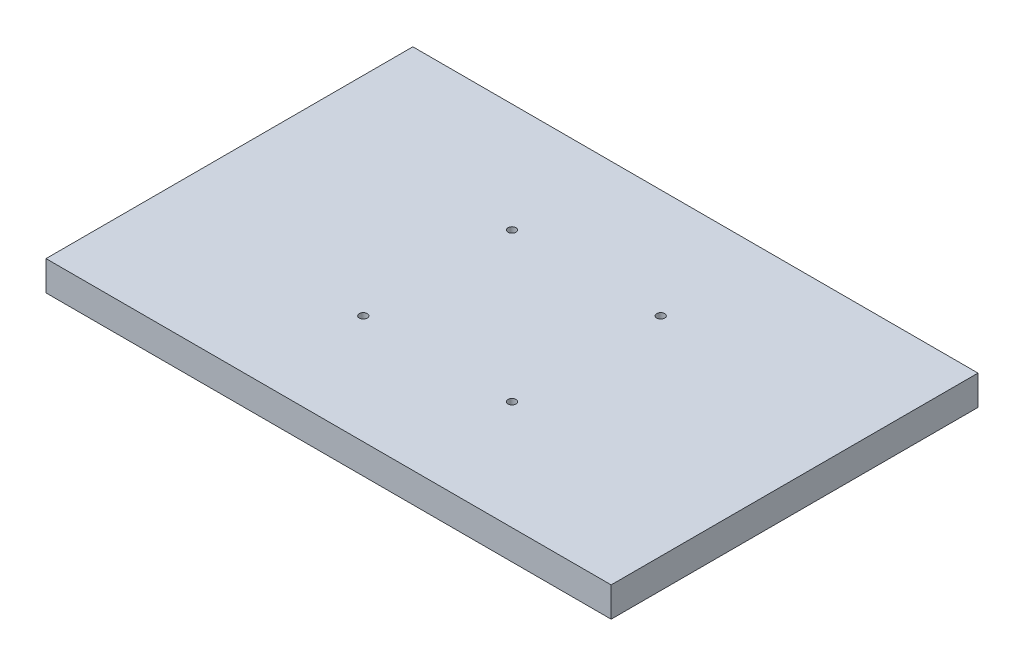
ISO-10303-21;
HEADER;
FILE_DESCRIPTION(('STEP AP214'),'2;1');
FILE_NAME('part.step','',(''),(''),'','','');
FILE_SCHEMA(('AUTOMOTIVE_DESIGN { 1 0 10303 214 1 1 1 1 }'));
ENDSEC;
DATA;
#1=APPLICATION_CONTEXT('core data for automotive mechanical design processes');
#2=APPLICATION_PROTOCOL_DEFINITION('international standard','automotive_design',2000,#1);
#3=PRODUCT_CONTEXT('',#1,'mechanical');
#4=PRODUCT('Part','Part','',(#3));
#5=PRODUCT_RELATED_PRODUCT_CATEGORY('part','',(#4));
#6=PRODUCT_DEFINITION_FORMATION('','',#4);
#7=PRODUCT_DEFINITION_CONTEXT('part definition',#1,'design');
#8=PRODUCT_DEFINITION('design','',#6,#7);
#9=PRODUCT_DEFINITION_SHAPE('','',#8);
#10=(LENGTH_UNIT() NAMED_UNIT(*) SI_UNIT(.MILLI.,.METRE.));
#11=(NAMED_UNIT(*) PLANE_ANGLE_UNIT() SI_UNIT($,.RADIAN.));
#12=(NAMED_UNIT(*) SI_UNIT($,.STERADIAN.) SOLID_ANGLE_UNIT());
#13=UNCERTAINTY_MEASURE_WITH_UNIT(LENGTH_MEASURE(1.E-05),#10,'distance_accuracy_value','');
#14=(GEOMETRIC_REPRESENTATION_CONTEXT(3) GLOBAL_UNCERTAINTY_ASSIGNED_CONTEXT((#13)) GLOBAL_UNIT_ASSIGNED_CONTEXT((#10,
#11,#12)) REPRESENTATION_CONTEXT('',''));
#15=CARTESIAN_POINT('',(0.,0.,0.));
#16=DIRECTION('',(0.,0.,1.));
#17=DIRECTION('',(1.,0.,0.));
#18=AXIS2_PLACEMENT_3D('',#15,#16,#17);
#19=CARTESIAN_POINT('',(142.5,14.,-92.5));
#20=DIRECTION('',(-1.,0.,0.));
#21=DIRECTION('',(0.,0.,1.));
#22=AXIS2_PLACEMENT_3D('',#19,#20,#21);
#23=PLANE('',#22);
#24=DIRECTION('',(0.,-1.,0.));
#25=VECTOR('',#24,1.);
#26=CARTESIAN_POINT('',(142.5,14.,92.5));
#27=LINE('',#26,#25);
#28=CARTESIAN_POINT('',(142.5,14.,92.5));
#29=VERTEX_POINT('',#28);
#30=CARTESIAN_POINT('',(142.5,-1.,92.5));
#31=VERTEX_POINT('',#30);
#32=EDGE_CURVE('E217',#29,#31,#27,.T.);
#33=ORIENTED_EDGE('',*,*,#32,.T.);
#34=DIRECTION('',(0.,0.,1.));
#35=VECTOR('',#34,1.);
#36=CARTESIAN_POINT('',(142.5,-1.,-92.5));
#37=LINE('',#36,#35);
#38=CARTESIAN_POINT('',(142.5,-1.,-92.5));
#39=VERTEX_POINT('',#38);
#40=EDGE_CURVE('E166',#39,#31,#37,.T.);
#41=ORIENTED_EDGE('',*,*,#40,.F.);
#42=DIRECTION('',(0.,-1.,0.));
#43=VECTOR('',#42,1.);
#44=CARTESIAN_POINT('',(142.5,14.,-92.5));
#45=LINE('',#44,#43);
#46=CARTESIAN_POINT('',(142.5,14.,-92.5));
#47=VERTEX_POINT('',#46);
#48=EDGE_CURVE('E11',#47,#39,#45,.T.);
#49=ORIENTED_EDGE('',*,*,#48,.F.);
#50=DIRECTION('',(0.,0.,-1.));
#51=VECTOR('',#50,1.);
#52=CARTESIAN_POINT('',(142.5,14.,-92.5));
#53=LINE('',#52,#51);
#54=EDGE_CURVE('E203',#29,#47,#53,.T.);
#55=ORIENTED_EDGE('',*,*,#54,.F.);
#56=EDGE_LOOP('',(#33,#41,#49,#55));
#57=FACE_BOUND('',#56,.T.);
#58=ADVANCED_FACE('F41',(#57),#23,.F.);
#59=CARTESIAN_POINT('',(-142.5,14.,-92.5));
#60=DIRECTION('',(0.,0.,1.));
#61=DIRECTION('',(1.,0.,0.));
#62=AXIS2_PLACEMENT_3D('',#59,#60,#61);
#63=PLANE('',#62);
#64=ORIENTED_EDGE('',*,*,#48,.T.);
#65=DIRECTION('',(1.,0.,0.));
#66=VECTOR('',#65,1.);
#67=CARTESIAN_POINT('',(-142.5,-1.,-92.5));
#68=LINE('',#67,#66);
#69=CARTESIAN_POINT('',(-142.5,-1.,-92.5));
#70=VERTEX_POINT('',#69);
#71=EDGE_CURVE('E162',#70,#39,#68,.T.);
#72=ORIENTED_EDGE('',*,*,#71,.F.);
#73=DIRECTION('',(0.,-1.,0.));
#74=VECTOR('',#73,1.);
#75=CARTESIAN_POINT('',(-142.5,14.,-92.5));
#76=LINE('',#75,#74);
#77=CARTESIAN_POINT('',(-142.5,14.,-92.5));
#78=VERTEX_POINT('',#77);
#79=EDGE_CURVE('E49',#78,#70,#76,.T.);
#80=ORIENTED_EDGE('',*,*,#79,.F.);
#81=DIRECTION('',(-1.,0.,0.));
#82=VECTOR('',#81,1.);
#83=CARTESIAN_POINT('',(-142.5,14.,-92.5));
#84=LINE('',#83,#82);
#85=EDGE_CURVE('E209',#47,#78,#84,.T.);
#86=ORIENTED_EDGE('',*,*,#85,.F.);
#87=EDGE_LOOP('',(#64,#72,#80,#86));
#88=FACE_BOUND('',#87,.T.);
#89=ADVANCED_FACE('F231',(#88),#63,.F.);
#90=CARTESIAN_POINT('',(-142.5,14.,-92.5));
#91=DIRECTION('',(1.,0.,0.));
#92=DIRECTION('',(0.,0.,-1.));
#93=AXIS2_PLACEMENT_3D('',#90,#91,#92);
#94=PLANE('',#93);
#95=ORIENTED_EDGE('',*,*,#79,.T.);
#96=DIRECTION('',(0.,0.,-1.));
#97=VECTOR('',#96,1.);
#98=CARTESIAN_POINT('',(-142.5,-1.,-92.5));
#99=LINE('',#98,#97);
#100=CARTESIAN_POINT('',(-142.5,-1.,92.5));
#101=VERTEX_POINT('',#100);
#102=EDGE_CURVE('E125',#101,#70,#99,.T.);
#103=ORIENTED_EDGE('',*,*,#102,.F.);
#104=DIRECTION('',(0.,-1.,0.));
#105=VECTOR('',#104,1.);
#106=CARTESIAN_POINT('',(-142.5,14.,92.5));
#107=LINE('',#106,#105);
#108=CARTESIAN_POINT('',(-142.5,14.,92.5));
#109=VERTEX_POINT('',#108);
#110=EDGE_CURVE('E220',#109,#101,#107,.T.);
#111=ORIENTED_EDGE('',*,*,#110,.F.);
#112=DIRECTION('',(0.,0.,1.));
#113=VECTOR('',#112,1.);
#114=CARTESIAN_POINT('',(-142.5,14.,-92.5));
#115=LINE('',#114,#113);
#116=EDGE_CURVE('E212',#78,#109,#115,.T.);
#117=ORIENTED_EDGE('',*,*,#116,.F.);
#118=EDGE_LOOP('',(#95,#103,#111,#117));
#119=FACE_BOUND('',#118,.T.);
#120=ADVANCED_FACE('F228',(#119),#94,.F.);
#121=CARTESIAN_POINT('',(-142.5,14.,92.5));
#122=DIRECTION('',(0.,0.,-1.));
#123=DIRECTION('',(-1.,0.,0.));
#124=AXIS2_PLACEMENT_3D('',#121,#122,#123);
#125=PLANE('',#124);
#126=ORIENTED_EDGE('',*,*,#110,.T.);
#127=DIRECTION('',(-1.,0.,0.));
#128=VECTOR('',#127,1.);
#129=CARTESIAN_POINT('',(142.5,-1.,92.5));
#130=LINE('',#129,#128);
#131=EDGE_CURVE('E170',#31,#101,#130,.T.);
#132=ORIENTED_EDGE('',*,*,#131,.F.);
#133=ORIENTED_EDGE('',*,*,#32,.F.);
#134=DIRECTION('',(1.,0.,0.));
#135=VECTOR('',#134,1.);
#136=CARTESIAN_POINT('',(-142.5,14.,92.5));
#137=LINE('',#136,#135);
#138=EDGE_CURVE('E64',#109,#29,#137,.T.);
#139=ORIENTED_EDGE('',*,*,#138,.F.);
#140=EDGE_LOOP('',(#126,#132,#133,#139));
#141=FACE_BOUND('',#140,.T.);
#142=ADVANCED_FACE('F237',(#141),#125,.F.);
#143=CARTESIAN_POINT('',(0.,14.,0.));
#144=DIRECTION('',(0.,1.,0.));
#145=DIRECTION('',(0.,0.,1.));
#146=AXIS2_PLACEMENT_3D('',#143,#144,#145);
#147=PLANE('',#146);
#148=CARTESIAN_POINT('',(-37.5,14.,37.5));
#149=DIRECTION('',(0.,1.,0.));
#150=DIRECTION('',(0.,0.,-1.));
#151=AXIS2_PLACEMENT_3D('',#148,#149,#150);
#152=CIRCLE('',#151,2.);
#153=CARTESIAN_POINT('',(-37.5,14.,35.5));
#154=VERTEX_POINT('',#153);
#155=EDGE_CURVE('E174',#154,#154,#152,.T.);
#156=ORIENTED_EDGE('',*,*,#155,.F.);
#157=EDGE_LOOP('',(#156));
#158=FACE_BOUND('',#157,.T.);
#159=CARTESIAN_POINT('',(37.5,14.,37.5));
#160=DIRECTION('',(0.,1.,0.));
#161=DIRECTION('',(0.,0.,1.));
#162=AXIS2_PLACEMENT_3D('',#159,#160,#161);
#163=CIRCLE('',#162,2.);
#164=CARTESIAN_POINT('',(37.5,14.,39.5));
#165=VERTEX_POINT('',#164);
#166=EDGE_CURVE('E188',#165,#165,#163,.T.);
#167=ORIENTED_EDGE('',*,*,#166,.F.);
#168=EDGE_LOOP('',(#167));
#169=FACE_BOUND('',#168,.T.);
#170=CARTESIAN_POINT('',(37.5,14.,-37.5));
#171=DIRECTION('',(0.,1.,0.));
#172=DIRECTION('',(0.,0.,-1.));
#173=AXIS2_PLACEMENT_3D('',#170,#171,#172);
#174=CIRCLE('',#173,2.);
#175=CARTESIAN_POINT('',(37.5,14.,-39.5));
#176=VERTEX_POINT('',#175);
#177=EDGE_CURVE('E180',#176,#176,#174,.T.);
#178=ORIENTED_EDGE('',*,*,#177,.F.);
#179=EDGE_LOOP('',(#178));
#180=FACE_BOUND('',#179,.T.);
#181=CARTESIAN_POINT('',(-37.5,14.,-37.5));
#182=DIRECTION('',(0.,1.,0.));
#183=DIRECTION('',(0.,0.,1.));
#184=AXIS2_PLACEMENT_3D('',#181,#182,#183);
#185=CIRCLE('',#184,2.);
#186=CARTESIAN_POINT('',(-37.5,14.,-35.5));
#187=VERTEX_POINT('',#186);
#188=EDGE_CURVE('E179',#187,#187,#185,.T.);
#189=ORIENTED_EDGE('',*,*,#188,.F.);
#190=EDGE_LOOP('',(#189));
#191=FACE_BOUND('',#190,.T.);
#192=ORIENTED_EDGE('',*,*,#54,.T.);
#193=ORIENTED_EDGE('',*,*,#85,.T.);
#194=ORIENTED_EDGE('',*,*,#116,.T.);
#195=ORIENTED_EDGE('',*,*,#138,.T.);
#196=EDGE_LOOP('',(#192,#193,#194,#195));
#197=FACE_BOUND('',#196,.T.);
#198=ADVANCED_FACE('F240',(#158,#169,#180,#191,#197),#147,.T.);
#199=CARTESIAN_POINT('',(-37.5,6.,-37.5));
#200=DIRECTION('',(0.,1.,0.));
#201=DIRECTION('',(0.,0.,1.));
#202=AXIS2_PLACEMENT_3D('',#199,#200,#201);
#203=CYLINDRICAL_SURFACE('',#202,2.);
#204=CARTESIAN_POINT('',(-37.5,6.,-37.5));
#205=DIRECTION('',(0.,1.,0.));
#206=DIRECTION('',(0.,0.,1.));
#207=AXIS2_PLACEMENT_3D('',#204,#205,#206);
#208=CIRCLE('',#207,2.);
#209=CARTESIAN_POINT('',(-37.5,6.,-35.5));
#210=VERTEX_POINT('',#209);
#211=EDGE_CURVE('E199',#210,#210,#208,.T.);
#212=ORIENTED_EDGE('',*,*,#211,.F.);
#213=EDGE_LOOP('',(#212));
#214=FACE_BOUND('',#213,.T.);
#215=ORIENTED_EDGE('',*,*,#188,.T.);
#216=EDGE_LOOP('',(#215));
#217=FACE_BOUND('',#216,.T.);
#218=ADVANCED_FACE('F242',(#214,#217),#203,.F.);
#219=CARTESIAN_POINT('',(-37.5,6.,-37.5));
#220=DIRECTION('',(0.,1.,0.));
#221=DIRECTION('',(0.,0.,1.));
#222=AXIS2_PLACEMENT_3D('',#219,#220,#221);
#223=PLANE('',#222);
#224=ORIENTED_EDGE('',*,*,#211,.T.);
#225=EDGE_LOOP('',(#224));
#226=FACE_BOUND('',#225,.T.);
#227=ADVANCED_FACE('F249',(#226),#223,.T.);
#228=CARTESIAN_POINT('',(37.5,6.,-37.5));
#229=DIRECTION('',(0.,1.,0.));
#230=DIRECTION('',(0.,0.,1.));
#231=AXIS2_PLACEMENT_3D('',#228,#229,#230);
#232=CYLINDRICAL_SURFACE('',#231,2.);
#233=CARTESIAN_POINT('',(37.5,6.,-37.5));
#234=DIRECTION('',(0.,1.,0.));
#235=DIRECTION('',(0.,0.,-1.));
#236=AXIS2_PLACEMENT_3D('',#233,#234,#235);
#237=CIRCLE('',#236,2.);
#238=CARTESIAN_POINT('',(37.5,6.,-39.5));
#239=VERTEX_POINT('',#238);
#240=EDGE_CURVE('E175',#239,#239,#237,.T.);
#241=ORIENTED_EDGE('',*,*,#240,.F.);
#242=EDGE_LOOP('',(#241));
#243=FACE_BOUND('',#242,.T.);
#244=ORIENTED_EDGE('',*,*,#177,.T.);
#245=EDGE_LOOP('',(#244));
#246=FACE_BOUND('',#245,.T.);
#247=ADVANCED_FACE('F291',(#243,#246),#232,.F.);
#248=CARTESIAN_POINT('',(37.5,6.,-37.5));
#249=DIRECTION('',(0.,-1.,0.));
#250=DIRECTION('',(0.,0.,-1.));
#251=AXIS2_PLACEMENT_3D('',#248,#249,#250);
#252=PLANE('',#251);
#253=ORIENTED_EDGE('',*,*,#240,.T.);
#254=EDGE_LOOP('',(#253));
#255=FACE_BOUND('',#254,.T.);
#256=ADVANCED_FACE('F287',(#255),#252,.F.);
#257=CARTESIAN_POINT('',(37.5,6.,37.5));
#258=DIRECTION('',(0.,1.,0.));
#259=DIRECTION('',(0.,0.,1.));
#260=AXIS2_PLACEMENT_3D('',#257,#258,#259);
#261=CYLINDRICAL_SURFACE('',#260,2.);
#262=CARTESIAN_POINT('',(37.5,6.,37.5));
#263=DIRECTION('',(0.,1.,0.));
#264=DIRECTION('',(0.,0.,1.));
#265=AXIS2_PLACEMENT_3D('',#262,#263,#264);
#266=CIRCLE('',#265,2.);
#267=CARTESIAN_POINT('',(37.5,6.,39.5));
#268=VERTEX_POINT('',#267);
#269=EDGE_CURVE('E184',#268,#268,#266,.T.);
#270=ORIENTED_EDGE('',*,*,#269,.F.);
#271=EDGE_LOOP('',(#270));
#272=FACE_BOUND('',#271,.T.);
#273=ORIENTED_EDGE('',*,*,#166,.T.);
#274=EDGE_LOOP('',(#273));
#275=FACE_BOUND('',#274,.T.);
#276=ADVANCED_FACE('F290',(#272,#275),#261,.F.);
#277=CARTESIAN_POINT('',(37.5,6.,37.5));
#278=DIRECTION('',(0.,1.,0.));
#279=DIRECTION('',(0.,0.,1.));
#280=AXIS2_PLACEMENT_3D('',#277,#278,#279);
#281=PLANE('',#280);
#282=ORIENTED_EDGE('',*,*,#269,.T.);
#283=EDGE_LOOP('',(#282));
#284=FACE_BOUND('',#283,.T.);
#285=ADVANCED_FACE('F296',(#284),#281,.T.);
#286=CARTESIAN_POINT('',(-37.5,6.,37.5));
#287=DIRECTION('',(0.,1.,0.));
#288=DIRECTION('',(0.,0.,1.));
#289=AXIS2_PLACEMENT_3D('',#286,#287,#288);
#290=CYLINDRICAL_SURFACE('',#289,2.);
#291=CARTESIAN_POINT('',(-37.5,6.,37.5));
#292=DIRECTION('',(0.,1.,0.));
#293=DIRECTION('',(0.,0.,-1.));
#294=AXIS2_PLACEMENT_3D('',#291,#292,#293);
#295=CIRCLE('',#294,2.);
#296=CARTESIAN_POINT('',(-37.5,6.,35.5));
#297=VERTEX_POINT('',#296);
#298=EDGE_CURVE('E192',#297,#297,#295,.T.);
#299=ORIENTED_EDGE('',*,*,#298,.F.);
#300=EDGE_LOOP('',(#299));
#301=FACE_BOUND('',#300,.T.);
#302=ORIENTED_EDGE('',*,*,#155,.T.);
#303=EDGE_LOOP('',(#302));
#304=FACE_BOUND('',#303,.T.);
#305=ADVANCED_FACE('F299',(#301,#304),#290,.F.);
#306=CARTESIAN_POINT('',(-37.5,6.,37.5));
#307=DIRECTION('',(0.,-1.,0.));
#308=DIRECTION('',(0.,0.,-1.));
#309=AXIS2_PLACEMENT_3D('',#306,#307,#308);
#310=PLANE('',#309);
#311=ORIENTED_EDGE('',*,*,#298,.T.);
#312=EDGE_LOOP('',(#311));
#313=FACE_BOUND('',#312,.T.);
#314=ADVANCED_FACE('F286',(#313),#310,.F.);
#315=CARTESIAN_POINT('',(0.,-1.,0.));
#316=DIRECTION('',(0.,1.,0.));
#317=DIRECTION('',(0.,0.,1.));
#318=AXIS2_PLACEMENT_3D('',#315,#316,#317);
#319=PLANE('',#318);
#320=ORIENTED_EDGE('',*,*,#102,.T.);
#321=ORIENTED_EDGE('',*,*,#71,.T.);
#322=ORIENTED_EDGE('',*,*,#40,.T.);
#323=ORIENTED_EDGE('',*,*,#131,.T.);
#324=EDGE_LOOP('',(#320,#321,#322,#323));
#325=FACE_BOUND('',#324,.T.);
#326=DIRECTION('',(0.,0.,1.));
#327=VECTOR('',#326,1.);
#328=CARTESIAN_POINT('',(137.5,-1.,87.5));
#329=LINE('',#328,#327);
#330=CARTESIAN_POINT('',(137.5,-1.,-68.5));
#331=VERTEX_POINT('',#330);
#332=CARTESIAN_POINT('',(137.5,-1.,87.5));
#333=VERTEX_POINT('',#332);
#334=EDGE_CURVE('E107',#331,#333,#329,.T.);
#335=ORIENTED_EDGE('',*,*,#334,.F.);
#336=DIRECTION('',(1.,0.,0.));
#337=VECTOR('',#336,1.);
#338=CARTESIAN_POINT('',(-137.5,-1.,-68.5));
#339=LINE('',#338,#337);
#340=CARTESIAN_POINT('',(-137.5,-1.,-68.5));
#341=VERTEX_POINT('',#340);
#342=EDGE_CURVE('E135',#341,#331,#339,.T.);
#343=ORIENTED_EDGE('',*,*,#342,.F.);
#344=DIRECTION('',(0.,0.,-1.));
#345=VECTOR('',#344,1.);
#346=CARTESIAN_POINT('',(-137.5,-1.,87.5));
#347=LINE('',#346,#345);
#348=CARTESIAN_POINT('',(-137.5,-1.,87.5));
#349=VERTEX_POINT('',#348);
#350=EDGE_CURVE('E131',#349,#341,#347,.T.);
#351=ORIENTED_EDGE('',*,*,#350,.F.);
#352=DIRECTION('',(-1.,0.,0.));
#353=VECTOR('',#352,1.);
#354=CARTESIAN_POINT('',(-137.5,-1.,87.5));
#355=LINE('',#354,#353);
#356=EDGE_CURVE('E116',#333,#349,#355,.T.);
#357=ORIENTED_EDGE('',*,*,#356,.F.);
#358=EDGE_LOOP('',(#335,#343,#351,#357));
#359=FACE_BOUND('',#358,.T.);
#360=ADVANCED_FACE('F129',(#325,#359),#319,.F.);
#361=CARTESIAN_POINT('',(137.5,-1.,87.5));
#362=DIRECTION('',(-1.,0.,0.));
#363=DIRECTION('',(0.,0.,1.));
#364=AXIS2_PLACEMENT_3D('',#361,#362,#363);
#365=PLANE('',#364);
#366=DIRECTION('',(0.,0.,1.));
#367=VECTOR('',#366,1.);
#368=CARTESIAN_POINT('',(137.5,0.,87.5));
#369=LINE('',#368,#367);
#370=CARTESIAN_POINT('',(137.5,0.,-68.5));
#371=VERTEX_POINT('',#370);
#372=CARTESIAN_POINT('',(137.5,0.,87.5));
#373=VERTEX_POINT('',#372);
#374=EDGE_CURVE('E140',#371,#373,#369,.T.);
#375=ORIENTED_EDGE('',*,*,#374,.F.);
#376=DIRECTION('',(0.,1.,0.));
#377=VECTOR('',#376,1.);
#378=CARTESIAN_POINT('',(137.5,-1.,-68.5));
#379=LINE('',#378,#377);
#380=EDGE_CURVE('E56',#331,#371,#379,.T.);
#381=ORIENTED_EDGE('',*,*,#380,.F.);
#382=ORIENTED_EDGE('',*,*,#334,.T.);
#383=DIRECTION('',(0.,1.,0.));
#384=VECTOR('',#383,1.);
#385=CARTESIAN_POINT('',(137.5,-1.,87.5));
#386=LINE('',#385,#384);
#387=EDGE_CURVE('E110',#333,#373,#386,.T.);
#388=ORIENTED_EDGE('',*,*,#387,.T.);
#389=EDGE_LOOP('',(#375,#381,#382,#388));
#390=FACE_BOUND('',#389,.T.);
#391=ADVANCED_FACE('F109',(#390),#365,.T.);
#392=CARTESIAN_POINT('',(-137.5,-1.,87.5));
#393=DIRECTION('',(0.,0.,-1.));
#394=DIRECTION('',(-1.,0.,0.));
#395=AXIS2_PLACEMENT_3D('',#392,#393,#394);
#396=PLANE('',#395);
#397=DIRECTION('',(-1.,0.,0.));
#398=VECTOR('',#397,1.);
#399=CARTESIAN_POINT('',(-137.5,0.,87.5));
#400=LINE('',#399,#398);
#401=CARTESIAN_POINT('',(-137.5,0.,87.5));
#402=VERTEX_POINT('',#401);
#403=EDGE_CURVE('E123',#373,#402,#400,.T.);
#404=ORIENTED_EDGE('',*,*,#403,.F.);
#405=ORIENTED_EDGE('',*,*,#387,.F.);
#406=ORIENTED_EDGE('',*,*,#356,.T.);
#407=DIRECTION('',(0.,1.,0.));
#408=VECTOR('',#407,1.);
#409=CARTESIAN_POINT('',(-137.5,-1.,87.5));
#410=LINE('',#409,#408);
#411=EDGE_CURVE('E126',#349,#402,#410,.T.);
#412=ORIENTED_EDGE('',*,*,#411,.T.);
#413=EDGE_LOOP('',(#404,#405,#406,#412));
#414=FACE_BOUND('',#413,.T.);
#415=ADVANCED_FACE('F120',(#414),#396,.T.);
#416=CARTESIAN_POINT('',(-137.5,-1.,87.5));
#417=DIRECTION('',(1.,0.,0.));
#418=DIRECTION('',(0.,0.,-1.));
#419=AXIS2_PLACEMENT_3D('',#416,#417,#418);
#420=PLANE('',#419);
#421=DIRECTION('',(0.,0.,-1.));
#422=VECTOR('',#421,1.);
#423=CARTESIAN_POINT('',(-137.5,0.,87.5));
#424=LINE('',#423,#422);
#425=CARTESIAN_POINT('',(-137.5,0.,-68.5));
#426=VERTEX_POINT('',#425);
#427=EDGE_CURVE('E145',#402,#426,#424,.T.);
#428=ORIENTED_EDGE('',*,*,#427,.F.);
#429=ORIENTED_EDGE('',*,*,#411,.F.);
#430=ORIENTED_EDGE('',*,*,#350,.T.);
#431=DIRECTION('',(0.,1.,0.));
#432=VECTOR('',#431,1.);
#433=CARTESIAN_POINT('',(-137.5,-1.,-68.5));
#434=LINE('',#433,#432);
#435=EDGE_CURVE('E154',#341,#426,#434,.T.);
#436=ORIENTED_EDGE('',*,*,#435,.T.);
#437=EDGE_LOOP('',(#428,#429,#430,#436));
#438=FACE_BOUND('',#437,.T.);
#439=ADVANCED_FACE('F271',(#438),#420,.T.);
#440=CARTESIAN_POINT('',(-137.5,-1.,-68.5));
#441=DIRECTION('',(0.,0.,1.));
#442=DIRECTION('',(1.,0.,0.));
#443=AXIS2_PLACEMENT_3D('',#440,#441,#442);
#444=PLANE('',#443);
#445=DIRECTION('',(1.,0.,0.));
#446=VECTOR('',#445,1.);
#447=CARTESIAN_POINT('',(-137.5,0.,-68.5));
#448=LINE('',#447,#446);
#449=EDGE_CURVE('E117',#426,#371,#448,.T.);
#450=ORIENTED_EDGE('',*,*,#449,.F.);
#451=ORIENTED_EDGE('',*,*,#435,.F.);
#452=ORIENTED_EDGE('',*,*,#342,.T.);
#453=ORIENTED_EDGE('',*,*,#380,.T.);
#454=EDGE_LOOP('',(#450,#451,#452,#453));
#455=FACE_BOUND('',#454,.T.);
#456=ADVANCED_FACE('F266',(#455),#444,.T.);
#457=CARTESIAN_POINT('',(0.,0.,0.));
#458=DIRECTION('',(0.,1.,0.));
#459=DIRECTION('',(0.,0.,1.));
#460=AXIS2_PLACEMENT_3D('',#457,#458,#459);
#461=PLANE('',#460);
#462=ORIENTED_EDGE('',*,*,#449,.T.);
#463=ORIENTED_EDGE('',*,*,#374,.T.);
#464=ORIENTED_EDGE('',*,*,#403,.T.);
#465=ORIENTED_EDGE('',*,*,#427,.T.);
#466=EDGE_LOOP('',(#462,#463,#464,#465));
#467=FACE_BOUND('',#466,.T.);
#468=ADVANCED_FACE('F264',(#467),#461,.F.);
#469=CLOSED_SHELL('',(#58,#89,#120,#142,#198,#218,#227,#247,#256,#276,#285,#305,#314,#360,#391,
#415,#439,#456,#468));
#470=MANIFOLD_SOLID_BREP('B2',#469);
#471=ADVANCED_BREP_SHAPE_REPRESENTATION('',(#18,#470),#14);
#472=SHAPE_DEFINITION_REPRESENTATION(#9,#471);
ENDSEC;
END-ISO-10303-21;
